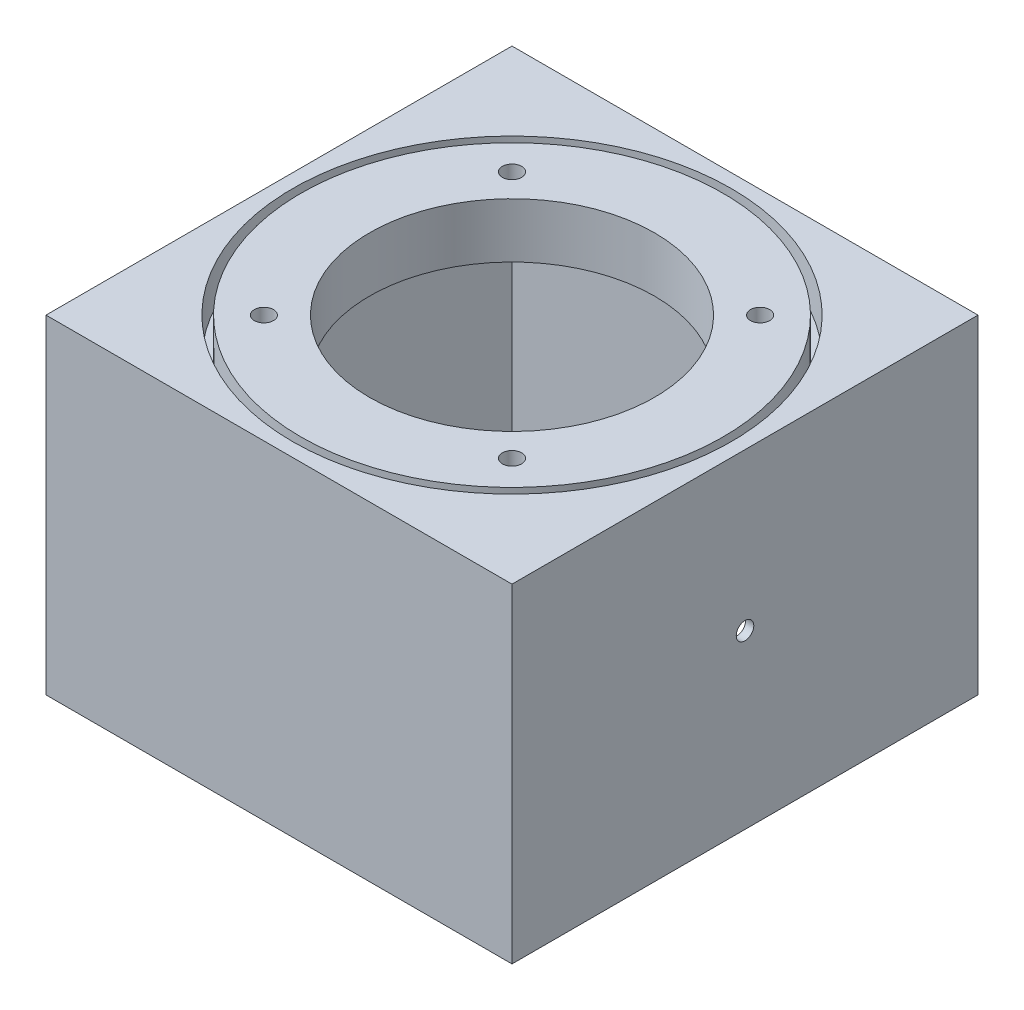
ISO-10303-21;
HEADER;
FILE_DESCRIPTION(('STEP AP214'),'2;1');
FILE_NAME('part.step','',(''),(''),'','','');
FILE_SCHEMA(('AUTOMOTIVE_DESIGN { 1 0 10303 214 1 1 1 1 }'));
ENDSEC;
DATA;
#1=APPLICATION_CONTEXT('core data for automotive mechanical design processes');
#2=APPLICATION_PROTOCOL_DEFINITION('international standard','automotive_design',2000,#1);
#3=PRODUCT_CONTEXT('',#1,'mechanical');
#4=PRODUCT('Part','Part','',(#3));
#5=PRODUCT_RELATED_PRODUCT_CATEGORY('part','',(#4));
#6=PRODUCT_DEFINITION_FORMATION('','',#4);
#7=PRODUCT_DEFINITION_CONTEXT('part definition',#1,'design');
#8=PRODUCT_DEFINITION('design','',#6,#7);
#9=PRODUCT_DEFINITION_SHAPE('','',#8);
#10=(LENGTH_UNIT() NAMED_UNIT(*) SI_UNIT(.MILLI.,.METRE.));
#11=(NAMED_UNIT(*) PLANE_ANGLE_UNIT() SI_UNIT($,.RADIAN.));
#12=(NAMED_UNIT(*) SI_UNIT($,.STERADIAN.) SOLID_ANGLE_UNIT());
#13=UNCERTAINTY_MEASURE_WITH_UNIT(LENGTH_MEASURE(1.E-05),#10,'distance_accuracy_value','');
#14=(GEOMETRIC_REPRESENTATION_CONTEXT(3) GLOBAL_UNCERTAINTY_ASSIGNED_CONTEXT((#13)) GLOBAL_UNIT_ASSIGNED_CONTEXT((#10,
#11,#12)) REPRESENTATION_CONTEXT('',''));
#15=CARTESIAN_POINT('',(0.,0.,0.));
#16=DIRECTION('',(0.,0.,1.));
#17=DIRECTION('',(1.,0.,0.));
#18=AXIS2_PLACEMENT_3D('',#15,#16,#17);
#19=CARTESIAN_POINT('',(0.,10.,0.));
#20=DIRECTION('',(0.,-1.,0.));
#21=DIRECTION('',(0.,0.,-1.));
#22=AXIS2_PLACEMENT_3D('',#19,#20,#21);
#23=PLANE('',#22);
#24=CARTESIAN_POINT('',(0.,10.,0.));
#25=DIRECTION('',(0.,1.,0.));
#26=DIRECTION('',(0.,0.,1.));
#27=AXIS2_PLACEMENT_3D('',#24,#25,#26);
#28=CIRCLE('',#27,26.);
#29=CARTESIAN_POINT('',(0.,10.,26.));
#30=VERTEX_POINT('',#29);
#31=EDGE_CURVE('E203',#30,#30,#28,.T.);
#32=ORIENTED_EDGE('',*,*,#31,.F.);
#33=EDGE_LOOP('',(#32));
#34=FACE_BOUND('',#33,.T.);
#35=CARTESIAN_POINT('',(22.6280700811869,10.,-22.628070081187));
#36=DIRECTION('',(0.,1.,0.));
#37=DIRECTION('',(0.,0.,1.));
#38=AXIS2_PLACEMENT_3D('',#35,#36,#37);
#39=CIRCLE('',#38,1.75);
#40=CARTESIAN_POINT('',(22.6280700811869,10.,-20.878070081187));
#41=VERTEX_POINT('',#40);
#42=EDGE_CURVE('E175',#41,#41,#39,.T.);
#43=ORIENTED_EDGE('',*,*,#42,.F.);
#44=EDGE_LOOP('',(#43));
#45=FACE_BOUND('',#44,.T.);
#46=CARTESIAN_POINT('',(-22.6267639147521,10.,-22.6267639147521));
#47=DIRECTION('',(0.,1.,0.));
#48=DIRECTION('',(0.,0.,1.));
#49=AXIS2_PLACEMENT_3D('',#46,#47,#48);
#50=CIRCLE('',#49,1.75);
#51=CARTESIAN_POINT('',(-22.6267639147521,10.,-20.8767639147521));
#52=VERTEX_POINT('',#51);
#53=EDGE_CURVE('E176',#52,#52,#50,.T.);
#54=ORIENTED_EDGE('',*,*,#53,.F.);
#55=EDGE_LOOP('',(#54));
#56=FACE_BOUND('',#55,.T.);
#57=CARTESIAN_POINT('',(-22.6267639147521,10.,22.6267639147521));
#58=DIRECTION('',(0.,1.,0.));
#59=DIRECTION('',(0.,0.,1.));
#60=AXIS2_PLACEMENT_3D('',#57,#58,#59);
#61=CIRCLE('',#60,1.75);
#62=CARTESIAN_POINT('',(-22.6267639147521,10.,24.3767639147521));
#63=VERTEX_POINT('',#62);
#64=EDGE_CURVE('E184',#63,#63,#61,.T.);
#65=ORIENTED_EDGE('',*,*,#64,.F.);
#66=EDGE_LOOP('',(#65));
#67=FACE_BOUND('',#66,.T.);
#68=CARTESIAN_POINT('',(22.628070081187,10.,22.6280700811869));
#69=DIRECTION('',(0.,1.,0.));
#70=DIRECTION('',(0.,0.,1.));
#71=AXIS2_PLACEMENT_3D('',#68,#69,#70);
#72=CIRCLE('',#71,1.75);
#73=CARTESIAN_POINT('',(22.628070081187,10.,24.378070081187));
#74=VERTEX_POINT('',#73);
#75=EDGE_CURVE('E170',#74,#74,#72,.T.);
#76=ORIENTED_EDGE('',*,*,#75,.F.);
#77=EDGE_LOOP('',(#76));
#78=FACE_BOUND('',#77,.T.);
#79=CARTESIAN_POINT('',(0.,10.,0.));
#80=DIRECTION('',(0.,1.,0.));
#81=DIRECTION('',(0.,0.,1.));
#82=AXIS2_PLACEMENT_3D('',#79,#80,#81);
#83=CIRCLE('',#82,38.5);
#84=CARTESIAN_POINT('',(0.,10.,38.5));
#85=VERTEX_POINT('',#84);
#86=EDGE_CURVE('E360',#85,#85,#83,.T.);
#87=ORIENTED_EDGE('',*,*,#86,.T.);
#88=EDGE_LOOP('',(#87));
#89=FACE_BOUND('',#88,.T.);
#90=ADVANCED_FACE('F39',(#34,#45,#56,#67,#78,#89),#23,.F.);
#91=CARTESIAN_POINT('',(0.,10.,0.));
#92=DIRECTION('',(0.,1.,0.));
#93=DIRECTION('',(0.,0.,1.));
#94=AXIS2_PLACEMENT_3D('',#91,#92,#93);
#95=CIRCLE('',#94,40.);
#96=CARTESIAN_POINT('',(0.,10.,40.));
#97=VERTEX_POINT('',#96);
#98=EDGE_CURVE('E291',#97,#97,#95,.T.);
#99=ORIENTED_EDGE('',*,*,#98,.F.);
#100=EDGE_LOOP('',(#99));
#101=FACE_BOUND('',#100,.T.);
#102=DIRECTION('',(0.,0.,-1.));
#103=VECTOR('',#102,1.);
#104=CARTESIAN_POINT('',(42.5,10.,42.5));
#105=LINE('',#104,#103);
#106=CARTESIAN_POINT('',(42.5,10.,42.5));
#107=VERTEX_POINT('',#106);
#108=CARTESIAN_POINT('',(42.5,10.,-42.5));
#109=VERTEX_POINT('',#108);
#110=EDGE_CURVE('E207',#107,#109,#105,.T.);
#111=ORIENTED_EDGE('',*,*,#110,.T.);
#112=DIRECTION('',(-1.,0.,0.));
#113=VECTOR('',#112,1.);
#114=CARTESIAN_POINT('',(-42.5,10.,-42.5));
#115=LINE('',#114,#113);
#116=CARTESIAN_POINT('',(-42.5,10.,-42.5));
#117=VERTEX_POINT('',#116);
#118=EDGE_CURVE('E214',#109,#117,#115,.T.);
#119=ORIENTED_EDGE('',*,*,#118,.T.);
#120=DIRECTION('',(0.,0.,1.));
#121=VECTOR('',#120,1.);
#122=CARTESIAN_POINT('',(-42.5,10.,42.5));
#123=LINE('',#122,#121);
#124=CARTESIAN_POINT('',(-42.5,10.,42.5));
#125=VERTEX_POINT('',#124);
#126=EDGE_CURVE('E217',#117,#125,#123,.T.);
#127=ORIENTED_EDGE('',*,*,#126,.T.);
#128=DIRECTION('',(1.,0.,0.));
#129=VECTOR('',#128,1.);
#130=CARTESIAN_POINT('',(-42.5,10.,42.5));
#131=LINE('',#130,#129);
#132=EDGE_CURVE('E220',#125,#107,#131,.T.);
#133=ORIENTED_EDGE('',*,*,#132,.T.);
#134=EDGE_LOOP('',(#111,#119,#127,#133));
#135=FACE_BOUND('',#134,.T.);
#136=ADVANCED_FACE('F249',(#101,#135),#23,.F.);
#137=CARTESIAN_POINT('',(0.,0.,0.));
#138=DIRECTION('',(0.,-1.,0.));
#139=DIRECTION('',(0.,0.,-1.));
#140=AXIS2_PLACEMENT_3D('',#137,#138,#139);
#141=PLANE('',#140);
#142=DIRECTION('',(0.,0.,-1.));
#143=VECTOR('',#142,1.);
#144=CARTESIAN_POINT('',(-41.,0.,41.));
#145=LINE('',#144,#143);
#146=CARTESIAN_POINT('',(-41.,0.,41.));
#147=VERTEX_POINT('',#146);
#148=CARTESIAN_POINT('',(-41.,0.,-41.));
#149=VERTEX_POINT('',#148);
#150=EDGE_CURVE('E56',#147,#149,#145,.T.);
#151=ORIENTED_EDGE('',*,*,#150,.T.);
#152=DIRECTION('',(1.,0.,0.));
#153=VECTOR('',#152,1.);
#154=CARTESIAN_POINT('',(41.,0.,-41.));
#155=LINE('',#154,#153);
#156=CARTESIAN_POINT('',(41.,0.,-41.));
#157=VERTEX_POINT('',#156);
#158=EDGE_CURVE('E60',#149,#157,#155,.T.);
#159=ORIENTED_EDGE('',*,*,#158,.T.);
#160=DIRECTION('',(0.,0.,1.));
#161=VECTOR('',#160,1.);
#162=CARTESIAN_POINT('',(41.,0.,41.));
#163=LINE('',#162,#161);
#164=CARTESIAN_POINT('',(41.,0.,41.));
#165=VERTEX_POINT('',#164);
#166=EDGE_CURVE('E142',#157,#165,#163,.T.);
#167=ORIENTED_EDGE('',*,*,#166,.T.);
#168=DIRECTION('',(-1.,0.,0.));
#169=VECTOR('',#168,1.);
#170=CARTESIAN_POINT('',(41.,0.,41.));
#171=LINE('',#170,#169);
#172=EDGE_CURVE('E115',#165,#147,#171,.T.);
#173=ORIENTED_EDGE('',*,*,#172,.T.);
#174=EDGE_LOOP('',(#151,#159,#167,#173));
#175=FACE_BOUND('',#174,.T.);
#176=CARTESIAN_POINT('',(22.628070081187,0.,22.6280700811869));
#177=DIRECTION('',(0.,1.,0.));
#178=DIRECTION('',(0.,0.,1.));
#179=AXIS2_PLACEMENT_3D('',#176,#177,#178);
#180=CIRCLE('',#179,1.75);
#181=CARTESIAN_POINT('',(22.628070081187,0.,24.378070081187));
#182=VERTEX_POINT('',#181);
#183=EDGE_CURVE('E188',#182,#182,#180,.T.);
#184=ORIENTED_EDGE('',*,*,#183,.T.);
#185=EDGE_LOOP('',(#184));
#186=FACE_BOUND('',#185,.T.);
#187=CARTESIAN_POINT('',(-22.6267639147521,0.,22.6267639147521));
#188=DIRECTION('',(0.,1.,0.));
#189=DIRECTION('',(0.,0.,1.));
#190=AXIS2_PLACEMENT_3D('',#187,#188,#189);
#191=CIRCLE('',#190,1.75);
#192=CARTESIAN_POINT('',(-22.6267639147521,0.,24.3767639147521));
#193=VERTEX_POINT('',#192);
#194=EDGE_CURVE('E180',#193,#193,#191,.T.);
#195=ORIENTED_EDGE('',*,*,#194,.T.);
#196=EDGE_LOOP('',(#195));
#197=FACE_BOUND('',#196,.T.);
#198=CARTESIAN_POINT('',(-22.6267639147521,0.,-22.6267639147521));
#199=DIRECTION('',(0.,1.,0.));
#200=DIRECTION('',(0.,0.,1.));
#201=AXIS2_PLACEMENT_3D('',#198,#199,#200);
#202=CIRCLE('',#201,1.75);
#203=CARTESIAN_POINT('',(-22.6267639147521,0.,-20.8767639147521));
#204=VERTEX_POINT('',#203);
#205=EDGE_CURVE('E171',#204,#204,#202,.T.);
#206=ORIENTED_EDGE('',*,*,#205,.T.);
#207=EDGE_LOOP('',(#206));
#208=FACE_BOUND('',#207,.T.);
#209=CARTESIAN_POINT('',(22.6280700811869,0.,-22.628070081187));
#210=DIRECTION('',(0.,1.,0.));
#211=DIRECTION('',(0.,0.,1.));
#212=AXIS2_PLACEMENT_3D('',#209,#210,#211);
#213=CIRCLE('',#212,1.75);
#214=CARTESIAN_POINT('',(22.6280700811869,0.,-20.878070081187));
#215=VERTEX_POINT('',#214);
#216=EDGE_CURVE('E195',#215,#215,#213,.T.);
#217=ORIENTED_EDGE('',*,*,#216,.T.);
#218=EDGE_LOOP('',(#217));
#219=FACE_BOUND('',#218,.T.);
#220=CARTESIAN_POINT('',(0.,0.,0.));
#221=DIRECTION('',(0.,1.,0.));
#222=DIRECTION('',(0.,0.,1.));
#223=AXIS2_PLACEMENT_3D('',#220,#221,#222);
#224=CIRCLE('',#223,26.);
#225=CARTESIAN_POINT('',(0.,0.,26.));
#226=VERTEX_POINT('',#225);
#227=EDGE_CURVE('E199',#226,#226,#224,.T.);
#228=ORIENTED_EDGE('',*,*,#227,.T.);
#229=EDGE_LOOP('',(#228));
#230=FACE_BOUND('',#229,.T.);
#231=ADVANCED_FACE('F252',(#175,#186,#197,#208,#219,#230),#141,.T.);
#232=CARTESIAN_POINT('',(42.5,10.,42.5));
#233=DIRECTION('',(-1.,0.,0.));
#234=DIRECTION('',(0.,0.,1.));
#235=AXIS2_PLACEMENT_3D('',#232,#233,#234);
#236=PLANE('',#235);
#237=CARTESIAN_POINT('',(42.5,-18.6,0.));
#238=DIRECTION('',(-1.,0.,0.));
#239=DIRECTION('',(0.,0.,1.));
#240=AXIS2_PLACEMENT_3D('',#237,#238,#239);
#241=CIRCLE('',#240,1.6);
#242=CARTESIAN_POINT('',(42.5,-18.6,1.6));
#243=VERTEX_POINT('',#242);
#244=EDGE_CURVE('E284',#243,#243,#241,.T.);
#245=ORIENTED_EDGE('',*,*,#244,.T.);
#246=EDGE_LOOP('',(#245));
#247=FACE_BOUND('',#246,.T.);
#248=DIRECTION('',(0.,-1.,0.));
#249=VECTOR('',#248,1.);
#250=CARTESIAN_POINT('',(42.5,10.,42.5));
#251=LINE('',#250,#249);
#252=CARTESIAN_POINT('',(42.5,-50.,42.5));
#253=VERTEX_POINT('',#252);
#254=EDGE_CURVE('E223',#107,#253,#251,.T.);
#255=ORIENTED_EDGE('',*,*,#254,.T.);
#256=DIRECTION('',(0.,0.,1.));
#257=VECTOR('',#256,1.);
#258=CARTESIAN_POINT('',(42.5,-50.,42.5));
#259=LINE('',#258,#257);
#260=CARTESIAN_POINT('',(42.5,-50.,-42.5));
#261=VERTEX_POINT('',#260);
#262=EDGE_CURVE('E162',#261,#253,#259,.T.);
#263=ORIENTED_EDGE('',*,*,#262,.F.);
#264=DIRECTION('',(0.,-1.,0.));
#265=VECTOR('',#264,1.);
#266=CARTESIAN_POINT('',(42.5,10.,-42.5));
#267=LINE('',#266,#265);
#268=EDGE_CURVE('E11',#109,#261,#267,.T.);
#269=ORIENTED_EDGE('',*,*,#268,.F.);
#270=ORIENTED_EDGE('',*,*,#110,.F.);
#271=EDGE_LOOP('',(#255,#263,#269,#270));
#272=FACE_BOUND('',#271,.T.);
#273=ADVANCED_FACE('F41',(#247,#272),#236,.F.);
#274=CARTESIAN_POINT('',(-42.5,10.,-42.5));
#275=DIRECTION('',(0.,0.,1.));
#276=DIRECTION('',(1.,0.,0.));
#277=AXIS2_PLACEMENT_3D('',#274,#275,#276);
#278=PLANE('',#277);
#279=ORIENTED_EDGE('',*,*,#268,.T.);
#280=DIRECTION('',(1.,0.,0.));
#281=VECTOR('',#280,1.);
#282=CARTESIAN_POINT('',(42.5,-50.,-42.5));
#283=LINE('',#282,#281);
#284=CARTESIAN_POINT('',(-42.5,-50.,-42.5));
#285=VERTEX_POINT('',#284);
#286=EDGE_CURVE('E158',#285,#261,#283,.T.);
#287=ORIENTED_EDGE('',*,*,#286,.F.);
#288=DIRECTION('',(0.,-1.,0.));
#289=VECTOR('',#288,1.);
#290=CARTESIAN_POINT('',(-42.5,10.,-42.5));
#291=LINE('',#290,#289);
#292=EDGE_CURVE('E49',#117,#285,#291,.T.);
#293=ORIENTED_EDGE('',*,*,#292,.F.);
#294=ORIENTED_EDGE('',*,*,#118,.F.);
#295=EDGE_LOOP('',(#279,#287,#293,#294));
#296=FACE_BOUND('',#295,.T.);
#297=ADVANCED_FACE('F238',(#296),#278,.F.);
#298=CARTESIAN_POINT('',(-42.5,10.,42.5));
#299=DIRECTION('',(1.,0.,0.));
#300=DIRECTION('',(0.,0.,-1.));
#301=AXIS2_PLACEMENT_3D('',#298,#299,#300);
#302=PLANE('',#301);
#303=CARTESIAN_POINT('',(-42.5,-18.6,0.));
#304=DIRECTION('',(-1.,0.,0.));
#305=DIRECTION('',(0.,0.,1.));
#306=AXIS2_PLACEMENT_3D('',#303,#304,#305);
#307=CIRCLE('',#306,1.6);
#308=CARTESIAN_POINT('',(-42.5,-18.6,1.6));
#309=VERTEX_POINT('',#308);
#310=EDGE_CURVE('E281',#309,#309,#307,.T.);
#311=ORIENTED_EDGE('',*,*,#310,.F.);
#312=EDGE_LOOP('',(#311));
#313=FACE_BOUND('',#312,.T.);
#314=ORIENTED_EDGE('',*,*,#292,.T.);
#315=DIRECTION('',(0.,0.,-1.));
#316=VECTOR('',#315,1.);
#317=CARTESIAN_POINT('',(-42.5,-50.,42.5));
#318=LINE('',#317,#316);
#319=CARTESIAN_POINT('',(-42.5,-50.,42.5));
#320=VERTEX_POINT('',#319);
#321=EDGE_CURVE('E121',#320,#285,#318,.T.);
#322=ORIENTED_EDGE('',*,*,#321,.F.);
#323=DIRECTION('',(0.,-1.,0.));
#324=VECTOR('',#323,1.);
#325=CARTESIAN_POINT('',(-42.5,10.,42.5));
#326=LINE('',#325,#324);
#327=EDGE_CURVE('E226',#125,#320,#326,.T.);
#328=ORIENTED_EDGE('',*,*,#327,.F.);
#329=ORIENTED_EDGE('',*,*,#126,.F.);
#330=EDGE_LOOP('',(#314,#322,#328,#329));
#331=FACE_BOUND('',#330,.T.);
#332=ADVANCED_FACE('F235',(#313,#331),#302,.F.);
#333=CARTESIAN_POINT('',(-42.5,10.,42.5));
#334=DIRECTION('',(0.,0.,-1.));
#335=DIRECTION('',(-1.,0.,0.));
#336=AXIS2_PLACEMENT_3D('',#333,#334,#335);
#337=PLANE('',#336);
#338=ORIENTED_EDGE('',*,*,#327,.T.);
#339=DIRECTION('',(-1.,0.,0.));
#340=VECTOR('',#339,1.);
#341=CARTESIAN_POINT('',(42.5,-50.,42.5));
#342=LINE('',#341,#340);
#343=EDGE_CURVE('E166',#253,#320,#342,.T.);
#344=ORIENTED_EDGE('',*,*,#343,.F.);
#345=ORIENTED_EDGE('',*,*,#254,.F.);
#346=ORIENTED_EDGE('',*,*,#132,.F.);
#347=EDGE_LOOP('',(#338,#344,#345,#346));
#348=FACE_BOUND('',#347,.T.);
#349=ADVANCED_FACE('F245',(#348),#337,.F.);
#350=CARTESIAN_POINT('',(0.,10.,0.));
#351=DIRECTION('',(0.,-1.,0.));
#352=DIRECTION('',(0.,0.,-1.));
#353=AXIS2_PLACEMENT_3D('',#350,#351,#352);
#354=CYLINDRICAL_SURFACE('',#353,26.);
#355=ORIENTED_EDGE('',*,*,#31,.T.);
#356=EDGE_LOOP('',(#355));
#357=FACE_BOUND('',#356,.T.);
#358=ORIENTED_EDGE('',*,*,#227,.F.);
#359=EDGE_LOOP('',(#358));
#360=FACE_BOUND('',#359,.T.);
#361=ADVANCED_FACE('F270',(#357,#360),#354,.F.);
#362=CARTESIAN_POINT('',(22.6280700811869,0.,-22.628070081187));
#363=DIRECTION('',(0.,1.,0.));
#364=DIRECTION('',(0.,0.,1.));
#365=AXIS2_PLACEMENT_3D('',#362,#363,#364);
#366=CYLINDRICAL_SURFACE('',#365,1.75);
#367=ORIENTED_EDGE('',*,*,#216,.F.);
#368=EDGE_LOOP('',(#367));
#369=FACE_BOUND('',#368,.T.);
#370=ORIENTED_EDGE('',*,*,#42,.T.);
#371=EDGE_LOOP('',(#370));
#372=FACE_BOUND('',#371,.T.);
#373=ADVANCED_FACE('F335',(#369,#372),#366,.F.);
#374=CARTESIAN_POINT('',(-22.6267639147521,0.,-22.6267639147521));
#375=DIRECTION('',(0.,1.,0.));
#376=DIRECTION('',(0.,0.,1.));
#377=AXIS2_PLACEMENT_3D('',#374,#375,#376);
#378=CYLINDRICAL_SURFACE('',#377,1.75);
#379=ORIENTED_EDGE('',*,*,#205,.F.);
#380=EDGE_LOOP('',(#379));
#381=FACE_BOUND('',#380,.T.);
#382=ORIENTED_EDGE('',*,*,#53,.T.);
#383=EDGE_LOOP('',(#382));
#384=FACE_BOUND('',#383,.T.);
#385=ADVANCED_FACE('F331',(#381,#384),#378,.F.);
#386=CARTESIAN_POINT('',(-22.6267639147521,0.,22.6267639147521));
#387=DIRECTION('',(0.,1.,0.));
#388=DIRECTION('',(0.,0.,1.));
#389=AXIS2_PLACEMENT_3D('',#386,#387,#388);
#390=CYLINDRICAL_SURFACE('',#389,1.75);
#391=ORIENTED_EDGE('',*,*,#194,.F.);
#392=EDGE_LOOP('',(#391));
#393=FACE_BOUND('',#392,.T.);
#394=ORIENTED_EDGE('',*,*,#64,.T.);
#395=EDGE_LOOP('',(#394));
#396=FACE_BOUND('',#395,.T.);
#397=ADVANCED_FACE('F334',(#393,#396),#390,.F.);
#398=CARTESIAN_POINT('',(22.628070081187,0.,22.6280700811869));
#399=DIRECTION('',(0.,1.,0.));
#400=DIRECTION('',(0.,0.,1.));
#401=AXIS2_PLACEMENT_3D('',#398,#399,#400);
#402=CYLINDRICAL_SURFACE('',#401,1.75);
#403=ORIENTED_EDGE('',*,*,#183,.F.);
#404=EDGE_LOOP('',(#403));
#405=FACE_BOUND('',#404,.T.);
#406=ORIENTED_EDGE('',*,*,#75,.T.);
#407=EDGE_LOOP('',(#406));
#408=FACE_BOUND('',#407,.T.);
#409=ADVANCED_FACE('F330',(#405,#408),#402,.F.);
#410=CARTESIAN_POINT('',(0.,-50.,0.));
#411=DIRECTION('',(0.,1.,0.));
#412=DIRECTION('',(0.,0.,1.));
#413=AXIS2_PLACEMENT_3D('',#410,#411,#412);
#414=PLANE('',#413);
#415=ORIENTED_EDGE('',*,*,#321,.T.);
#416=ORIENTED_EDGE('',*,*,#286,.T.);
#417=ORIENTED_EDGE('',*,*,#262,.T.);
#418=ORIENTED_EDGE('',*,*,#343,.T.);
#419=EDGE_LOOP('',(#415,#416,#417,#418));
#420=FACE_BOUND('',#419,.T.);
#421=DIRECTION('',(0.,0.,-1.));
#422=VECTOR('',#421,1.);
#423=CARTESIAN_POINT('',(-41.,-50.,41.));
#424=LINE('',#423,#422);
#425=CARTESIAN_POINT('',(-41.,-50.,41.));
#426=VERTEX_POINT('',#425);
#427=CARTESIAN_POINT('',(-41.,-50.,-41.));
#428=VERTEX_POINT('',#427);
#429=EDGE_CURVE('E104',#426,#428,#424,.T.);
#430=ORIENTED_EDGE('',*,*,#429,.F.);
#431=DIRECTION('',(-1.,0.,0.));
#432=VECTOR('',#431,1.);
#433=CARTESIAN_POINT('',(41.,-50.,41.));
#434=LINE('',#433,#432);
#435=CARTESIAN_POINT('',(41.,-50.,41.));
#436=VERTEX_POINT('',#435);
#437=EDGE_CURVE('E131',#436,#426,#434,.T.);
#438=ORIENTED_EDGE('',*,*,#437,.F.);
#439=DIRECTION('',(0.,0.,1.));
#440=VECTOR('',#439,1.);
#441=CARTESIAN_POINT('',(41.,-50.,41.));
#442=LINE('',#441,#440);
#443=CARTESIAN_POINT('',(41.,-50.,-41.));
#444=VERTEX_POINT('',#443);
#445=EDGE_CURVE('E127',#444,#436,#442,.T.);
#446=ORIENTED_EDGE('',*,*,#445,.F.);
#447=DIRECTION('',(1.,0.,0.));
#448=VECTOR('',#447,1.);
#449=CARTESIAN_POINT('',(41.,-50.,-41.));
#450=LINE('',#449,#448);
#451=EDGE_CURVE('E114',#428,#444,#450,.T.);
#452=ORIENTED_EDGE('',*,*,#451,.F.);
#453=EDGE_LOOP('',(#430,#438,#446,#452));
#454=FACE_BOUND('',#453,.T.);
#455=ADVANCED_FACE('F125',(#420,#454),#414,.F.);
#456=CARTESIAN_POINT('',(-41.,-50.,41.));
#457=DIRECTION('',(1.,0.,0.));
#458=DIRECTION('',(0.,0.,-1.));
#459=AXIS2_PLACEMENT_3D('',#456,#457,#458);
#460=PLANE('',#459);
#461=CARTESIAN_POINT('',(-41.,-18.6,0.));
#462=DIRECTION('',(1.,0.,0.));
#463=DIRECTION('',(0.,0.,-1.));
#464=AXIS2_PLACEMENT_3D('',#461,#462,#463);
#465=CIRCLE('',#464,1.6);
#466=CARTESIAN_POINT('',(-41.,-18.6,-1.6));
#467=VERTEX_POINT('',#466);
#468=EDGE_CURVE('E139',#467,#467,#465,.T.);
#469=ORIENTED_EDGE('',*,*,#468,.F.);
#470=EDGE_LOOP('',(#469));
#471=FACE_BOUND('',#470,.T.);
#472=ORIENTED_EDGE('',*,*,#150,.F.);
#473=DIRECTION('',(0.,1.,0.));
#474=VECTOR('',#473,1.);
#475=CARTESIAN_POINT('',(-41.,-50.,41.));
#476=LINE('',#475,#474);
#477=EDGE_CURVE('E109',#426,#147,#476,.T.);
#478=ORIENTED_EDGE('',*,*,#477,.F.);
#479=ORIENTED_EDGE('',*,*,#429,.T.);
#480=DIRECTION('',(0.,1.,0.));
#481=VECTOR('',#480,1.);
#482=CARTESIAN_POINT('',(-41.,-50.,-41.));
#483=LINE('',#482,#481);
#484=EDGE_CURVE('E107',#428,#149,#483,.T.);
#485=ORIENTED_EDGE('',*,*,#484,.T.);
#486=EDGE_LOOP('',(#472,#478,#479,#485));
#487=FACE_BOUND('',#486,.T.);
#488=ADVANCED_FACE('F106',(#471,#487),#460,.T.);
#489=CARTESIAN_POINT('',(41.,-50.,-41.));
#490=DIRECTION('',(0.,0.,1.));
#491=DIRECTION('',(1.,0.,0.));
#492=AXIS2_PLACEMENT_3D('',#489,#490,#491);
#493=PLANE('',#492);
#494=ORIENTED_EDGE('',*,*,#158,.F.);
#495=ORIENTED_EDGE('',*,*,#484,.F.);
#496=ORIENTED_EDGE('',*,*,#451,.T.);
#497=DIRECTION('',(0.,1.,0.));
#498=VECTOR('',#497,1.);
#499=CARTESIAN_POINT('',(41.,-50.,-41.));
#500=LINE('',#499,#498);
#501=EDGE_CURVE('E122',#444,#157,#500,.T.);
#502=ORIENTED_EDGE('',*,*,#501,.T.);
#503=EDGE_LOOP('',(#494,#495,#496,#502));
#504=FACE_BOUND('',#503,.T.);
#505=ADVANCED_FACE('F118',(#504),#493,.T.);
#506=CARTESIAN_POINT('',(41.,-50.,41.));
#507=DIRECTION('',(-1.,0.,0.));
#508=DIRECTION('',(0.,0.,1.));
#509=AXIS2_PLACEMENT_3D('',#506,#507,#508);
#510=PLANE('',#509);
#511=CARTESIAN_POINT('',(41.,-18.6,0.));
#512=DIRECTION('',(-1.,0.,0.));
#513=DIRECTION('',(0.,0.,1.));
#514=AXIS2_PLACEMENT_3D('',#511,#512,#513);
#515=CIRCLE('',#514,1.6);
#516=CARTESIAN_POINT('',(41.,-18.6,1.6));
#517=VERTEX_POINT('',#516);
#518=EDGE_CURVE('E43',#517,#517,#515,.T.);
#519=ORIENTED_EDGE('',*,*,#518,.F.);
#520=EDGE_LOOP('',(#519));
#521=FACE_BOUND('',#520,.T.);
#522=ORIENTED_EDGE('',*,*,#166,.F.);
#523=ORIENTED_EDGE('',*,*,#501,.F.);
#524=ORIENTED_EDGE('',*,*,#445,.T.);
#525=DIRECTION('',(0.,1.,0.));
#526=VECTOR('',#525,1.);
#527=CARTESIAN_POINT('',(41.,-50.,41.));
#528=LINE('',#527,#526);
#529=EDGE_CURVE('E149',#436,#165,#528,.T.);
#530=ORIENTED_EDGE('',*,*,#529,.T.);
#531=EDGE_LOOP('',(#522,#523,#524,#530));
#532=FACE_BOUND('',#531,.T.);
#533=ADVANCED_FACE('F305',(#521,#532),#510,.T.);
#534=CARTESIAN_POINT('',(41.,-50.,41.));
#535=DIRECTION('',(0.,0.,-1.));
#536=DIRECTION('',(-1.,0.,0.));
#537=AXIS2_PLACEMENT_3D('',#534,#535,#536);
#538=PLANE('',#537);
#539=ORIENTED_EDGE('',*,*,#172,.F.);
#540=ORIENTED_EDGE('',*,*,#529,.F.);
#541=ORIENTED_EDGE('',*,*,#437,.T.);
#542=ORIENTED_EDGE('',*,*,#477,.T.);
#543=EDGE_LOOP('',(#539,#540,#541,#542));
#544=FACE_BOUND('',#543,.T.);
#545=ADVANCED_FACE('F308',(#544),#538,.T.);
#546=CARTESIAN_POINT('',(42.5,-18.6,0.));
#547=DIRECTION('',(-1.,0.,0.));
#548=DIRECTION('',(0.,0.,1.));
#549=AXIS2_PLACEMENT_3D('',#546,#547,#548);
#550=CYLINDRICAL_SURFACE('',#549,1.6);
#551=ORIENTED_EDGE('',*,*,#518,.T.);
#552=EDGE_LOOP('',(#551));
#553=FACE_BOUND('',#552,.T.);
#554=ORIENTED_EDGE('',*,*,#244,.F.);
#555=EDGE_LOOP('',(#554));
#556=FACE_BOUND('',#555,.T.);
#557=ADVANCED_FACE('F302',(#553,#556),#550,.F.);
#558=ORIENTED_EDGE('',*,*,#468,.T.);
#559=EDGE_LOOP('',(#558));
#560=FACE_BOUND('',#559,.T.);
#561=ORIENTED_EDGE('',*,*,#310,.T.);
#562=EDGE_LOOP('',(#561));
#563=FACE_BOUND('',#562,.T.);
#564=ADVANCED_FACE('F319',(#560,#563),#550,.F.);
#565=CARTESIAN_POINT('',(0.,3.,0.));
#566=DIRECTION('',(0.,1.,0.));
#567=DIRECTION('',(0.,0.,1.));
#568=AXIS2_PLACEMENT_3D('',#565,#566,#567);
#569=CYLINDRICAL_SURFACE('',#568,40.);
#570=CARTESIAN_POINT('',(0.,3.,0.));
#571=DIRECTION('',(0.,1.,0.));
#572=DIRECTION('',(0.,0.,1.));
#573=AXIS2_PLACEMENT_3D('',#570,#571,#572);
#574=CIRCLE('',#573,40.);
#575=CARTESIAN_POINT('',(0.,3.,40.));
#576=VERTEX_POINT('',#575);
#577=EDGE_CURVE('E285',#576,#576,#574,.T.);
#578=ORIENTED_EDGE('',*,*,#577,.F.);
#579=EDGE_LOOP('',(#578));
#580=FACE_BOUND('',#579,.T.);
#581=ORIENTED_EDGE('',*,*,#98,.T.);
#582=EDGE_LOOP('',(#581));
#583=FACE_BOUND('',#582,.T.);
#584=ADVANCED_FACE('F372',(#580,#583),#569,.F.);
#585=CARTESIAN_POINT('',(0.,3.,0.));
#586=DIRECTION('',(0.,1.,0.));
#587=DIRECTION('',(0.,0.,1.));
#588=AXIS2_PLACEMENT_3D('',#585,#586,#587);
#589=PLANE('',#588);
#590=CARTESIAN_POINT('',(0.,3.,0.));
#591=DIRECTION('',(0.,1.,0.));
#592=DIRECTION('',(0.,0.,1.));
#593=AXIS2_PLACEMENT_3D('',#590,#591,#592);
#594=CIRCLE('',#593,38.5);
#595=CARTESIAN_POINT('',(0.,3.,38.5));
#596=VERTEX_POINT('',#595);
#597=EDGE_CURVE('E363',#596,#596,#594,.T.);
#598=ORIENTED_EDGE('',*,*,#597,.F.);
#599=EDGE_LOOP('',(#598));
#600=FACE_BOUND('',#599,.T.);
#601=ORIENTED_EDGE('',*,*,#577,.T.);
#602=EDGE_LOOP('',(#601));
#603=FACE_BOUND('',#602,.T.);
#604=ADVANCED_FACE('F374',(#600,#603),#589,.T.);
#605=CARTESIAN_POINT('',(0.,3.,0.));
#606=DIRECTION('',(0.,1.,0.));
#607=DIRECTION('',(0.,0.,1.));
#608=AXIS2_PLACEMENT_3D('',#605,#606,#607);
#609=CYLINDRICAL_SURFACE('',#608,38.5);
#610=ORIENTED_EDGE('',*,*,#597,.T.);
#611=EDGE_LOOP('',(#610));
#612=FACE_BOUND('',#611,.T.);
#613=ORIENTED_EDGE('',*,*,#86,.F.);
#614=EDGE_LOOP('',(#613));
#615=FACE_BOUND('',#614,.T.);
#616=ADVANCED_FACE('F380',(#612,#615),#609,.T.);
#617=CLOSED_SHELL('',(#90,#136,#231,#273,#297,#332,#349,#361,#373,#385,#397,#409,#455,#488,#505,
#533,#545,#557,#564,#584,#604,#616));
#618=MANIFOLD_SOLID_BREP('B2',#617);
#619=ADVANCED_BREP_SHAPE_REPRESENTATION('',(#18,#618),#14);
#620=SHAPE_DEFINITION_REPRESENTATION(#9,#619);
ENDSEC;
END-ISO-10303-21;
